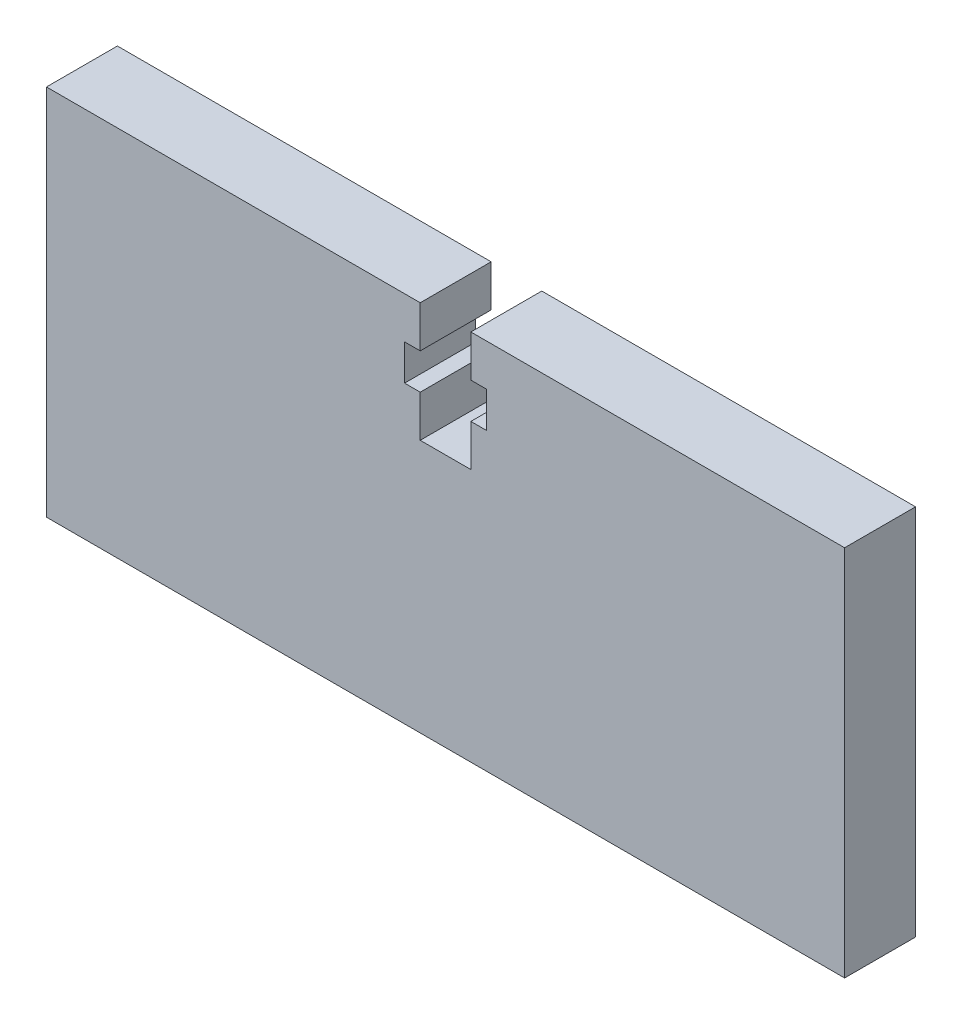
ISO-10303-21;
HEADER;
FILE_DESCRIPTION(('STEP AP214'),'2;1');
FILE_NAME('part.step','',(''),(''),'','','');
FILE_SCHEMA(('AUTOMOTIVE_DESIGN { 1 0 10303 214 1 1 1 1 }'));
ENDSEC;
DATA;
#1=APPLICATION_CONTEXT('core data for automotive mechanical design processes');
#2=APPLICATION_PROTOCOL_DEFINITION('international standard','automotive_design',2000,#1);
#3=PRODUCT_CONTEXT('',#1,'mechanical');
#4=PRODUCT('Part','Part','',(#3));
#5=PRODUCT_RELATED_PRODUCT_CATEGORY('part','',(#4));
#6=PRODUCT_DEFINITION_FORMATION('','',#4);
#7=PRODUCT_DEFINITION_CONTEXT('part definition',#1,'design');
#8=PRODUCT_DEFINITION('design','',#6,#7);
#9=PRODUCT_DEFINITION_SHAPE('','',#8);
#10=(LENGTH_UNIT() NAMED_UNIT(*) SI_UNIT(.MILLI.,.METRE.));
#11=(NAMED_UNIT(*) PLANE_ANGLE_UNIT() SI_UNIT($,.RADIAN.));
#12=(NAMED_UNIT(*) SI_UNIT($,.STERADIAN.) SOLID_ANGLE_UNIT());
#13=UNCERTAINTY_MEASURE_WITH_UNIT(LENGTH_MEASURE(1.E-05),#10,'distance_accuracy_value','');
#14=(GEOMETRIC_REPRESENTATION_CONTEXT(3) GLOBAL_UNCERTAINTY_ASSIGNED_CONTEXT((#13)) GLOBAL_UNIT_ASSIGNED_CONTEXT((#10,
#11,#12)) REPRESENTATION_CONTEXT('',''));
#15=CARTESIAN_POINT('',(0.,0.,0.));
#16=DIRECTION('',(0.,0.,1.));
#17=DIRECTION('',(1.,0.,0.));
#18=AXIS2_PLACEMENT_3D('',#15,#16,#17);
#19=CARTESIAN_POINT('',(-26.797,0.,4.7625));
#20=DIRECTION('',(-1.,0.,0.));
#21=DIRECTION('',(0.,0.,1.));
#22=AXIS2_PLACEMENT_3D('',#19,#20,#21);
#23=PLANE('',#22);
#24=DIRECTION('',(0.,1.,0.));
#25=VECTOR('',#24,1.);
#26=CARTESIAN_POINT('',(-26.797,0.,0.));
#27=LINE('',#26,#25);
#28=CARTESIAN_POINT('',(-26.797,-8.51,0.));
#29=VERTEX_POINT('',#28);
#30=CARTESIAN_POINT('',(-26.797,16.51,0.));
#31=VERTEX_POINT('',#30);
#32=EDGE_CURVE('E178',#29,#31,#27,.T.);
#33=ORIENTED_EDGE('',*,*,#32,.F.);
#34=DIRECTION('',(0.,0.,-1.));
#35=VECTOR('',#34,1.);
#36=CARTESIAN_POINT('',(-26.797,-8.51,4.7625));
#37=LINE('',#36,#35);
#38=CARTESIAN_POINT('',(-26.797,-8.51,4.7625));
#39=VERTEX_POINT('',#38);
#40=EDGE_CURVE('E11',#39,#29,#37,.T.);
#41=ORIENTED_EDGE('',*,*,#40,.F.);
#42=DIRECTION('',(0.,1.,0.));
#43=VECTOR('',#42,1.);
#44=CARTESIAN_POINT('',(-26.797,0.,4.7625));
#45=LINE('',#44,#43);
#46=CARTESIAN_POINT('',(-26.797,16.51,4.7625));
#47=VERTEX_POINT('',#46);
#48=EDGE_CURVE('E220',#39,#47,#45,.T.);
#49=ORIENTED_EDGE('',*,*,#48,.T.);
#50=DIRECTION('',(0.,0.,-1.));
#51=VECTOR('',#50,1.);
#52=CARTESIAN_POINT('',(-26.797,16.51,4.7625));
#53=LINE('',#52,#51);
#54=EDGE_CURVE('E52',#47,#31,#53,.T.);
#55=ORIENTED_EDGE('',*,*,#54,.T.);
#56=EDGE_LOOP('',(#33,#41,#49,#55));
#57=FACE_BOUND('',#56,.T.);
#58=ADVANCED_FACE('F36',(#57),#23,.T.);
#59=CARTESIAN_POINT('',(0.,-8.51,4.7625));
#60=DIRECTION('',(0.,1.,0.));
#61=DIRECTION('',(-1.,0.,0.));
#62=AXIS2_PLACEMENT_3D('',#59,#60,#61);
#63=PLANE('',#62);
#64=DIRECTION('',(1.,0.,0.));
#65=VECTOR('',#64,1.);
#66=CARTESIAN_POINT('',(0.,-8.51,0.));
#67=LINE('',#66,#65);
#68=CARTESIAN_POINT('',(26.797,-8.51,0.));
#69=VERTEX_POINT('',#68);
#70=EDGE_CURVE('E181',#29,#69,#67,.T.);
#71=ORIENTED_EDGE('',*,*,#70,.T.);
#72=DIRECTION('',(0.,0.,-1.));
#73=VECTOR('',#72,1.);
#74=CARTESIAN_POINT('',(26.797,-8.51,4.7625));
#75=LINE('',#74,#73);
#76=CARTESIAN_POINT('',(26.797,-8.51,4.7625));
#77=VERTEX_POINT('',#76);
#78=EDGE_CURVE('E44',#77,#69,#75,.T.);
#79=ORIENTED_EDGE('',*,*,#78,.F.);
#80=DIRECTION('',(1.,0.,0.));
#81=VECTOR('',#80,1.);
#82=CARTESIAN_POINT('',(0.,-8.51,4.7625));
#83=LINE('',#82,#81);
#84=EDGE_CURVE('E274',#39,#77,#83,.T.);
#85=ORIENTED_EDGE('',*,*,#84,.F.);
#86=ORIENTED_EDGE('',*,*,#40,.T.);
#87=EDGE_LOOP('',(#71,#79,#85,#86));
#88=FACE_BOUND('',#87,.T.);
#89=ADVANCED_FACE('F308',(#88),#63,.F.);
#90=CARTESIAN_POINT('',(26.797,0.,4.7625));
#91=DIRECTION('',(-1.,0.,0.));
#92=DIRECTION('',(0.,0.,1.));
#93=AXIS2_PLACEMENT_3D('',#90,#91,#92);
#94=PLANE('',#93);
#95=DIRECTION('',(0.,1.,0.));
#96=VECTOR('',#95,1.);
#97=CARTESIAN_POINT('',(26.797,0.,0.));
#98=LINE('',#97,#96);
#99=CARTESIAN_POINT('',(26.797,16.51,0.));
#100=VERTEX_POINT('',#99);
#101=EDGE_CURVE('E183',#69,#100,#98,.T.);
#102=ORIENTED_EDGE('',*,*,#101,.T.);
#103=DIRECTION('',(0.,0.,-1.));
#104=VECTOR('',#103,1.);
#105=CARTESIAN_POINT('',(26.797,16.51,4.7625));
#106=LINE('',#105,#104);
#107=CARTESIAN_POINT('',(26.797,16.51,4.7625));
#108=VERTEX_POINT('',#107);
#109=EDGE_CURVE('E247',#108,#100,#106,.T.);
#110=ORIENTED_EDGE('',*,*,#109,.F.);
#111=DIRECTION('',(0.,1.,0.));
#112=VECTOR('',#111,1.);
#113=CARTESIAN_POINT('',(26.797,0.,4.7625));
#114=LINE('',#113,#112);
#115=EDGE_CURVE('E255',#77,#108,#114,.T.);
#116=ORIENTED_EDGE('',*,*,#115,.F.);
#117=ORIENTED_EDGE('',*,*,#78,.T.);
#118=EDGE_LOOP('',(#102,#110,#116,#117));
#119=FACE_BOUND('',#118,.T.);
#120=ADVANCED_FACE('F253',(#119),#94,.F.);
#121=CARTESIAN_POINT('',(0.,16.51,4.7625));
#122=DIRECTION('',(0.,1.,0.));
#123=DIRECTION('',(-1.,0.,0.));
#124=AXIS2_PLACEMENT_3D('',#121,#122,#123);
#125=PLANE('',#124);
#126=DIRECTION('',(1.,0.,0.));
#127=VECTOR('',#126,1.);
#128=CARTESIAN_POINT('',(0.,16.51,0.));
#129=LINE('',#128,#127);
#130=CARTESIAN_POINT('',(1.69999999999999,16.51,0.));
#131=VERTEX_POINT('',#130);
#132=EDGE_CURVE('E187',#131,#100,#129,.T.);
#133=ORIENTED_EDGE('',*,*,#132,.F.);
#134=DIRECTION('',(0.,0.,-1.));
#135=VECTOR('',#134,1.);
#136=CARTESIAN_POINT('',(1.69999999999999,16.51,4.7625));
#137=LINE('',#136,#135);
#138=CARTESIAN_POINT('',(1.69999999999999,16.51,4.7625));
#139=VERTEX_POINT('',#138);
#140=EDGE_CURVE('E245',#139,#131,#137,.T.);
#141=ORIENTED_EDGE('',*,*,#140,.F.);
#142=DIRECTION('',(1.,0.,0.));
#143=VECTOR('',#142,1.);
#144=CARTESIAN_POINT('',(0.,16.51,4.7625));
#145=LINE('',#144,#143);
#146=EDGE_CURVE('E268',#139,#108,#145,.T.);
#147=ORIENTED_EDGE('',*,*,#146,.T.);
#148=ORIENTED_EDGE('',*,*,#109,.T.);
#149=EDGE_LOOP('',(#133,#141,#147,#148));
#150=FACE_BOUND('',#149,.T.);
#151=ADVANCED_FACE('F264',(#150),#125,.T.);
#152=CARTESIAN_POINT('',(1.70000000000004,0.,4.7625));
#153=DIRECTION('',(1.,0.,0.));
#154=DIRECTION('',(0.,1.,0.));
#155=AXIS2_PLACEMENT_3D('',#152,#153,#154);
#156=PLANE('',#155);
#157=DIRECTION('',(0.,-1.,0.));
#158=VECTOR('',#157,1.);
#159=CARTESIAN_POINT('',(1.70000000000004,0.,0.));
#160=LINE('',#159,#158);
#161=CARTESIAN_POINT('',(1.7,13.71,0.));
#162=VERTEX_POINT('',#161);
#163=EDGE_CURVE('E190',#131,#162,#160,.T.);
#164=ORIENTED_EDGE('',*,*,#163,.T.);
#165=DIRECTION('',(0.,0.,-1.));
#166=VECTOR('',#165,1.);
#167=CARTESIAN_POINT('',(1.7,13.71,4.7625));
#168=LINE('',#167,#166);
#169=CARTESIAN_POINT('',(1.7,13.71,4.7625));
#170=VERTEX_POINT('',#169);
#171=EDGE_CURVE('E242',#170,#162,#168,.T.);
#172=ORIENTED_EDGE('',*,*,#171,.F.);
#173=DIRECTION('',(0.,-1.,0.));
#174=VECTOR('',#173,1.);
#175=CARTESIAN_POINT('',(1.70000000000004,0.,4.7625));
#176=LINE('',#175,#174);
#177=EDGE_CURVE('E269',#139,#170,#176,.T.);
#178=ORIENTED_EDGE('',*,*,#177,.F.);
#179=ORIENTED_EDGE('',*,*,#140,.T.);
#180=EDGE_LOOP('',(#164,#172,#178,#179));
#181=FACE_BOUND('',#180,.T.);
#182=ADVANCED_FACE('F319',(#181),#156,.F.);
#183=CARTESIAN_POINT('',(0.,13.71,4.7625));
#184=DIRECTION('',(0.,1.,0.));
#185=DIRECTION('',(0.,0.,1.));
#186=AXIS2_PLACEMENT_3D('',#183,#184,#185);
#187=PLANE('',#186);
#188=DIRECTION('',(1.,0.,0.));
#189=VECTOR('',#188,1.);
#190=CARTESIAN_POINT('',(0.,13.71,0.));
#191=LINE('',#190,#189);
#192=CARTESIAN_POINT('',(2.75,13.71,0.));
#193=VERTEX_POINT('',#192);
#194=EDGE_CURVE('E192',#162,#193,#191,.T.);
#195=ORIENTED_EDGE('',*,*,#194,.T.);
#196=DIRECTION('',(0.,0.,-1.));
#197=VECTOR('',#196,1.);
#198=CARTESIAN_POINT('',(2.75,13.71,4.7625));
#199=LINE('',#198,#197);
#200=CARTESIAN_POINT('',(2.75,13.71,4.7625));
#201=VERTEX_POINT('',#200);
#202=EDGE_CURVE('E239',#201,#193,#199,.T.);
#203=ORIENTED_EDGE('',*,*,#202,.F.);
#204=DIRECTION('',(1.,0.,0.));
#205=VECTOR('',#204,1.);
#206=CARTESIAN_POINT('',(0.,13.71,4.7625));
#207=LINE('',#206,#205);
#208=EDGE_CURVE('E271',#170,#201,#207,.T.);
#209=ORIENTED_EDGE('',*,*,#208,.F.);
#210=ORIENTED_EDGE('',*,*,#171,.T.);
#211=EDGE_LOOP('',(#195,#203,#209,#210));
#212=FACE_BOUND('',#211,.T.);
#213=ADVANCED_FACE('F322',(#212),#187,.F.);
#214=CARTESIAN_POINT('',(2.75,0.,4.7625));
#215=DIRECTION('',(1.,0.,0.));
#216=DIRECTION('',(0.,0.,-1.));
#217=AXIS2_PLACEMENT_3D('',#214,#215,#216);
#218=PLANE('',#217);
#219=DIRECTION('',(0.,-1.,0.));
#220=VECTOR('',#219,1.);
#221=CARTESIAN_POINT('',(2.75,0.,0.));
#222=LINE('',#221,#220);
#223=CARTESIAN_POINT('',(2.75,11.31,0.));
#224=VERTEX_POINT('',#223);
#225=EDGE_CURVE('E194',#193,#224,#222,.T.);
#226=ORIENTED_EDGE('',*,*,#225,.T.);
#227=DIRECTION('',(0.,0.,-1.));
#228=VECTOR('',#227,1.);
#229=CARTESIAN_POINT('',(2.75,11.31,4.7625));
#230=LINE('',#229,#228);
#231=CARTESIAN_POINT('',(2.75,11.31,4.7625));
#232=VERTEX_POINT('',#231);
#233=EDGE_CURVE('E236',#232,#224,#230,.T.);
#234=ORIENTED_EDGE('',*,*,#233,.F.);
#235=DIRECTION('',(0.,-1.,0.));
#236=VECTOR('',#235,1.);
#237=CARTESIAN_POINT('',(2.75,0.,4.7625));
#238=LINE('',#237,#236);
#239=EDGE_CURVE('E279',#201,#232,#238,.T.);
#240=ORIENTED_EDGE('',*,*,#239,.F.);
#241=ORIENTED_EDGE('',*,*,#202,.T.);
#242=EDGE_LOOP('',(#226,#234,#240,#241));
#243=FACE_BOUND('',#242,.T.);
#244=ADVANCED_FACE('F326',(#243),#218,.F.);
#245=CARTESIAN_POINT('',(0.,11.31,4.7625));
#246=DIRECTION('',(0.,-1.,0.));
#247=DIRECTION('',(0.,0.,-1.));
#248=AXIS2_PLACEMENT_3D('',#245,#246,#247);
#249=PLANE('',#248);
#250=DIRECTION('',(-1.,0.,0.));
#251=VECTOR('',#250,1.);
#252=CARTESIAN_POINT('',(0.,11.31,0.));
#253=LINE('',#252,#251);
#254=CARTESIAN_POINT('',(1.7,11.31,0.));
#255=VERTEX_POINT('',#254);
#256=EDGE_CURVE('E196',#224,#255,#253,.T.);
#257=ORIENTED_EDGE('',*,*,#256,.T.);
#258=DIRECTION('',(0.,0.,-1.));
#259=VECTOR('',#258,1.);
#260=CARTESIAN_POINT('',(1.7,11.31,4.7625));
#261=LINE('',#260,#259);
#262=CARTESIAN_POINT('',(1.7,11.31,4.7625));
#263=VERTEX_POINT('',#262);
#264=EDGE_CURVE('E233',#263,#255,#261,.T.);
#265=ORIENTED_EDGE('',*,*,#264,.F.);
#266=DIRECTION('',(-1.,0.,0.));
#267=VECTOR('',#266,1.);
#268=CARTESIAN_POINT('',(0.,11.31,4.7625));
#269=LINE('',#268,#267);
#270=EDGE_CURVE('E281',#232,#263,#269,.T.);
#271=ORIENTED_EDGE('',*,*,#270,.F.);
#272=ORIENTED_EDGE('',*,*,#233,.T.);
#273=EDGE_LOOP('',(#257,#265,#271,#272));
#274=FACE_BOUND('',#273,.T.);
#275=ADVANCED_FACE('F330',(#274),#249,.F.);
#276=CARTESIAN_POINT('',(1.69999999999988,0.,4.7625));
#277=DIRECTION('',(1.,0.,0.));
#278=DIRECTION('',(0.,1.,0.));
#279=AXIS2_PLACEMENT_3D('',#276,#277,#278);
#280=PLANE('',#279);
#281=DIRECTION('',(0.,-1.,0.));
#282=VECTOR('',#281,1.);
#283=CARTESIAN_POINT('',(1.69999999999988,0.,0.));
#284=LINE('',#283,#282);
#285=CARTESIAN_POINT('',(1.69999999999997,8.51,0.));
#286=VERTEX_POINT('',#285);
#287=EDGE_CURVE('E198',#255,#286,#284,.T.);
#288=ORIENTED_EDGE('',*,*,#287,.T.);
#289=DIRECTION('',(0.,0.,-1.));
#290=VECTOR('',#289,1.);
#291=CARTESIAN_POINT('',(1.69999999999997,8.51,4.7625));
#292=LINE('',#291,#290);
#293=CARTESIAN_POINT('',(1.69999999999997,8.51,4.7625));
#294=VERTEX_POINT('',#293);
#295=EDGE_CURVE('E231',#294,#286,#292,.T.);
#296=ORIENTED_EDGE('',*,*,#295,.F.);
#297=DIRECTION('',(0.,-1.,0.));
#298=VECTOR('',#297,1.);
#299=CARTESIAN_POINT('',(1.69999999999988,0.,4.7625));
#300=LINE('',#299,#298);
#301=EDGE_CURVE('E283',#263,#294,#300,.T.);
#302=ORIENTED_EDGE('',*,*,#301,.F.);
#303=ORIENTED_EDGE('',*,*,#264,.T.);
#304=EDGE_LOOP('',(#288,#296,#302,#303));
#305=FACE_BOUND('',#304,.T.);
#306=ADVANCED_FACE('F334',(#305),#280,.F.);
#307=CARTESIAN_POINT('',(0.,8.51,4.7625));
#308=DIRECTION('',(0.,1.,0.));
#309=DIRECTION('',(-1.,0.,0.));
#310=AXIS2_PLACEMENT_3D('',#307,#308,#309);
#311=PLANE('',#310);
#312=DIRECTION('',(1.,0.,0.));
#313=VECTOR('',#312,1.);
#314=CARTESIAN_POINT('',(0.,8.51,0.));
#315=LINE('',#314,#313);
#316=CARTESIAN_POINT('',(-1.7,8.51,0.));
#317=VERTEX_POINT('',#316);
#318=EDGE_CURVE('E201',#317,#286,#315,.T.);
#319=ORIENTED_EDGE('',*,*,#318,.F.);
#320=DIRECTION('',(0.,0.,-1.));
#321=VECTOR('',#320,1.);
#322=CARTESIAN_POINT('',(-1.7,8.51,4.7625));
#323=LINE('',#322,#321);
#324=CARTESIAN_POINT('',(-1.7,8.51,4.7625));
#325=VERTEX_POINT('',#324);
#326=EDGE_CURVE('E229',#325,#317,#323,.T.);
#327=ORIENTED_EDGE('',*,*,#326,.F.);
#328=DIRECTION('',(1.,0.,0.));
#329=VECTOR('',#328,1.);
#330=CARTESIAN_POINT('',(0.,8.51,4.7625));
#331=LINE('',#330,#329);
#332=EDGE_CURVE('E285',#325,#294,#331,.T.);
#333=ORIENTED_EDGE('',*,*,#332,.T.);
#334=ORIENTED_EDGE('',*,*,#295,.T.);
#335=EDGE_LOOP('',(#319,#327,#333,#334));
#336=FACE_BOUND('',#335,.T.);
#337=ADVANCED_FACE('F338',(#336),#311,.T.);
#338=CARTESIAN_POINT('',(-1.7,0.,4.7625));
#339=DIRECTION('',(1.,0.,0.));
#340=DIRECTION('',(0.,1.,0.));
#341=AXIS2_PLACEMENT_3D('',#338,#339,#340);
#342=PLANE('',#341);
#343=DIRECTION('',(0.,-1.,0.));
#344=VECTOR('',#343,1.);
#345=CARTESIAN_POINT('',(-1.7,0.,0.));
#346=LINE('',#345,#344);
#347=CARTESIAN_POINT('',(-1.7,11.31,0.));
#348=VERTEX_POINT('',#347);
#349=EDGE_CURVE('E205',#348,#317,#346,.T.);
#350=ORIENTED_EDGE('',*,*,#349,.F.);
#351=DIRECTION('',(0.,0.,-1.));
#352=VECTOR('',#351,1.);
#353=CARTESIAN_POINT('',(-1.7,11.31,4.7625));
#354=LINE('',#353,#352);
#355=CARTESIAN_POINT('',(-1.7,11.31,4.7625));
#356=VERTEX_POINT('',#355);
#357=EDGE_CURVE('E227',#356,#348,#354,.T.);
#358=ORIENTED_EDGE('',*,*,#357,.F.);
#359=DIRECTION('',(0.,-1.,0.));
#360=VECTOR('',#359,1.);
#361=CARTESIAN_POINT('',(-1.7,0.,4.7625));
#362=LINE('',#361,#360);
#363=EDGE_CURVE('E288',#356,#325,#362,.T.);
#364=ORIENTED_EDGE('',*,*,#363,.T.);
#365=ORIENTED_EDGE('',*,*,#326,.T.);
#366=EDGE_LOOP('',(#350,#358,#364,#365));
#367=FACE_BOUND('',#366,.T.);
#368=ADVANCED_FACE('F342',(#367),#342,.T.);
#369=CARTESIAN_POINT('',(0.,11.31,4.7625));
#370=DIRECTION('',(0.,1.,0.));
#371=DIRECTION('',(0.,0.,1.));
#372=AXIS2_PLACEMENT_3D('',#369,#370,#371);
#373=PLANE('',#372);
#374=DIRECTION('',(1.,0.,0.));
#375=VECTOR('',#374,1.);
#376=CARTESIAN_POINT('',(0.,11.31,0.));
#377=LINE('',#376,#375);
#378=CARTESIAN_POINT('',(-2.75,11.31,0.));
#379=VERTEX_POINT('',#378);
#380=EDGE_CURVE('E208',#379,#348,#377,.T.);
#381=ORIENTED_EDGE('',*,*,#380,.F.);
#382=DIRECTION('',(0.,0.,-1.));
#383=VECTOR('',#382,1.);
#384=CARTESIAN_POINT('',(-2.75,11.31,4.7625));
#385=LINE('',#384,#383);
#386=CARTESIAN_POINT('',(-2.75,11.31,4.7625));
#387=VERTEX_POINT('',#386);
#388=EDGE_CURVE('E225',#387,#379,#385,.T.);
#389=ORIENTED_EDGE('',*,*,#388,.F.);
#390=DIRECTION('',(1.,0.,0.));
#391=VECTOR('',#390,1.);
#392=CARTESIAN_POINT('',(0.,11.31,4.7625));
#393=LINE('',#392,#391);
#394=EDGE_CURVE('E291',#387,#356,#393,.T.);
#395=ORIENTED_EDGE('',*,*,#394,.T.);
#396=ORIENTED_EDGE('',*,*,#357,.T.);
#397=EDGE_LOOP('',(#381,#389,#395,#396));
#398=FACE_BOUND('',#397,.T.);
#399=ADVANCED_FACE('F346',(#398),#373,.T.);
#400=CARTESIAN_POINT('',(-2.75,0.,4.7625));
#401=DIRECTION('',(1.,0.,0.));
#402=DIRECTION('',(0.,0.,-1.));
#403=AXIS2_PLACEMENT_3D('',#400,#401,#402);
#404=PLANE('',#403);
#405=DIRECTION('',(0.,-1.,0.));
#406=VECTOR('',#405,1.);
#407=CARTESIAN_POINT('',(-2.75,0.,0.));
#408=LINE('',#407,#406);
#409=CARTESIAN_POINT('',(-2.75,13.71,0.));
#410=VERTEX_POINT('',#409);
#411=EDGE_CURVE('E211',#410,#379,#408,.T.);
#412=ORIENTED_EDGE('',*,*,#411,.F.);
#413=DIRECTION('',(0.,0.,-1.));
#414=VECTOR('',#413,1.);
#415=CARTESIAN_POINT('',(-2.75,13.71,4.7625));
#416=LINE('',#415,#414);
#417=CARTESIAN_POINT('',(-2.75,13.71,4.7625));
#418=VERTEX_POINT('',#417);
#419=EDGE_CURVE('E159',#418,#410,#416,.T.);
#420=ORIENTED_EDGE('',*,*,#419,.F.);
#421=DIRECTION('',(0.,-1.,0.));
#422=VECTOR('',#421,1.);
#423=CARTESIAN_POINT('',(-2.75,0.,4.7625));
#424=LINE('',#423,#422);
#425=EDGE_CURVE('E170',#418,#387,#424,.T.);
#426=ORIENTED_EDGE('',*,*,#425,.T.);
#427=ORIENTED_EDGE('',*,*,#388,.T.);
#428=EDGE_LOOP('',(#412,#420,#426,#427));
#429=FACE_BOUND('',#428,.T.);
#430=ADVANCED_FACE('F295',(#429),#404,.T.);
#431=CARTESIAN_POINT('',(0.,13.71,4.7625));
#432=DIRECTION('',(0.,-1.,0.));
#433=DIRECTION('',(0.,0.,-1.));
#434=AXIS2_PLACEMENT_3D('',#431,#432,#433);
#435=PLANE('',#434);
#436=DIRECTION('',(-1.,0.,0.));
#437=VECTOR('',#436,1.);
#438=CARTESIAN_POINT('',(0.,13.71,0.));
#439=LINE('',#438,#437);
#440=CARTESIAN_POINT('',(-1.7,13.71,0.));
#441=VERTEX_POINT('',#440);
#442=EDGE_CURVE('E155',#441,#410,#439,.T.);
#443=ORIENTED_EDGE('',*,*,#442,.F.);
#444=DIRECTION('',(0.,0.,-1.));
#445=VECTOR('',#444,1.);
#446=CARTESIAN_POINT('',(-1.7,13.71,4.7625));
#447=LINE('',#446,#445);
#448=CARTESIAN_POINT('',(-1.7,13.71,4.7625));
#449=VERTEX_POINT('',#448);
#450=EDGE_CURVE('E150',#449,#441,#447,.T.);
#451=ORIENTED_EDGE('',*,*,#450,.F.);
#452=DIRECTION('',(-1.,0.,0.));
#453=VECTOR('',#452,1.);
#454=CARTESIAN_POINT('',(0.,13.71,4.7625));
#455=LINE('',#454,#453);
#456=EDGE_CURVE('E153',#449,#418,#455,.T.);
#457=ORIENTED_EDGE('',*,*,#456,.T.);
#458=ORIENTED_EDGE('',*,*,#419,.T.);
#459=EDGE_LOOP('',(#443,#451,#457,#458));
#460=FACE_BOUND('',#459,.T.);
#461=ADVANCED_FACE('F152',(#460),#435,.T.);
#462=CARTESIAN_POINT('',(-1.7,0.,4.7625));
#463=DIRECTION('',(1.,0.,0.));
#464=DIRECTION('',(0.,1.,0.));
#465=AXIS2_PLACEMENT_3D('',#462,#463,#464);
#466=PLANE('',#465);
#467=DIRECTION('',(0.,-1.,0.));
#468=VECTOR('',#467,1.);
#469=CARTESIAN_POINT('',(-1.7,0.,0.));
#470=LINE('',#469,#468);
#471=CARTESIAN_POINT('',(-1.7,16.51,0.));
#472=VERTEX_POINT('',#471);
#473=EDGE_CURVE('E215',#472,#441,#470,.T.);
#474=ORIENTED_EDGE('',*,*,#473,.F.);
#475=DIRECTION('',(0.,0.,-1.));
#476=VECTOR('',#475,1.);
#477=CARTESIAN_POINT('',(-1.7,16.51,4.7625));
#478=LINE('',#477,#476);
#479=CARTESIAN_POINT('',(-1.7,16.51,4.7625));
#480=VERTEX_POINT('',#479);
#481=EDGE_CURVE('E101',#480,#472,#478,.T.);
#482=ORIENTED_EDGE('',*,*,#481,.F.);
#483=DIRECTION('',(0.,-1.,0.));
#484=VECTOR('',#483,1.);
#485=CARTESIAN_POINT('',(-1.7,0.,4.7625));
#486=LINE('',#485,#484);
#487=EDGE_CURVE('E167',#480,#449,#486,.T.);
#488=ORIENTED_EDGE('',*,*,#487,.T.);
#489=ORIENTED_EDGE('',*,*,#450,.T.);
#490=EDGE_LOOP('',(#474,#482,#488,#489));
#491=FACE_BOUND('',#490,.T.);
#492=ADVANCED_FACE('F172',(#491),#466,.T.);
#493=CARTESIAN_POINT('',(0.,16.51,4.7625));
#494=DIRECTION('',(0.,1.,0.));
#495=DIRECTION('',(0.,0.,1.));
#496=AXIS2_PLACEMENT_3D('',#493,#494,#495);
#497=PLANE('',#496);
#498=DIRECTION('',(1.,0.,0.));
#499=VECTOR('',#498,1.);
#500=CARTESIAN_POINT('',(0.,16.51,0.));
#501=LINE('',#500,#499);
#502=EDGE_CURVE('E217',#31,#472,#501,.T.);
#503=ORIENTED_EDGE('',*,*,#502,.F.);
#504=ORIENTED_EDGE('',*,*,#54,.F.);
#505=DIRECTION('',(1.,0.,0.));
#506=VECTOR('',#505,1.);
#507=CARTESIAN_POINT('',(0.,16.51,4.7625));
#508=LINE('',#507,#506);
#509=EDGE_CURVE('E173',#47,#480,#508,.T.);
#510=ORIENTED_EDGE('',*,*,#509,.T.);
#511=ORIENTED_EDGE('',*,*,#481,.T.);
#512=EDGE_LOOP('',(#503,#504,#510,#511));
#513=FACE_BOUND('',#512,.T.);
#514=ADVANCED_FACE('F297',(#513),#497,.T.);
#515=CARTESIAN_POINT('',(0.,0.,4.7625));
#516=DIRECTION('',(0.,0.,1.));
#517=DIRECTION('',(1.,0.,0.));
#518=AXIS2_PLACEMENT_3D('',#515,#516,#517);
#519=PLANE('',#518);
#520=ORIENTED_EDGE('',*,*,#48,.F.);
#521=ORIENTED_EDGE('',*,*,#84,.T.);
#522=ORIENTED_EDGE('',*,*,#115,.T.);
#523=ORIENTED_EDGE('',*,*,#146,.F.);
#524=ORIENTED_EDGE('',*,*,#177,.T.);
#525=ORIENTED_EDGE('',*,*,#208,.T.);
#526=ORIENTED_EDGE('',*,*,#239,.T.);
#527=ORIENTED_EDGE('',*,*,#270,.T.);
#528=ORIENTED_EDGE('',*,*,#301,.T.);
#529=ORIENTED_EDGE('',*,*,#332,.F.);
#530=ORIENTED_EDGE('',*,*,#363,.F.);
#531=ORIENTED_EDGE('',*,*,#394,.F.);
#532=ORIENTED_EDGE('',*,*,#425,.F.);
#533=ORIENTED_EDGE('',*,*,#456,.F.);
#534=ORIENTED_EDGE('',*,*,#487,.F.);
#535=ORIENTED_EDGE('',*,*,#509,.F.);
#536=EDGE_LOOP('',(#520,#521,#522,#523,#524,#525,#526,#527,#528,#529,#530,#531,#532,#533,#534,#535));
#537=FACE_BOUND('',#536,.T.);
#538=ADVANCED_FACE('F165',(#537),#519,.T.);
#539=CARTESIAN_POINT('',(0.,0.,0.));
#540=DIRECTION('',(0.,0.,1.));
#541=DIRECTION('',(1.,0.,0.));
#542=AXIS2_PLACEMENT_3D('',#539,#540,#541);
#543=PLANE('',#542);
#544=ORIENTED_EDGE('',*,*,#32,.T.);
#545=ORIENTED_EDGE('',*,*,#502,.T.);
#546=ORIENTED_EDGE('',*,*,#473,.T.);
#547=ORIENTED_EDGE('',*,*,#442,.T.);
#548=ORIENTED_EDGE('',*,*,#411,.T.);
#549=ORIENTED_EDGE('',*,*,#380,.T.);
#550=ORIENTED_EDGE('',*,*,#349,.T.);
#551=ORIENTED_EDGE('',*,*,#318,.T.);
#552=ORIENTED_EDGE('',*,*,#287,.F.);
#553=ORIENTED_EDGE('',*,*,#256,.F.);
#554=ORIENTED_EDGE('',*,*,#225,.F.);
#555=ORIENTED_EDGE('',*,*,#194,.F.);
#556=ORIENTED_EDGE('',*,*,#163,.F.);
#557=ORIENTED_EDGE('',*,*,#132,.T.);
#558=ORIENTED_EDGE('',*,*,#101,.F.);
#559=ORIENTED_EDGE('',*,*,#70,.F.);
#560=EDGE_LOOP('',(#544,#545,#546,#547,#548,#549,#550,#551,#552,#553,#554,#555,#556,#557,#558,#559));
#561=FACE_BOUND('',#560,.T.);
#562=ADVANCED_FACE('F259',(#561),#543,.F.);
#563=CLOSED_SHELL('',(#58,#89,#120,#151,#182,#213,#244,#275,#306,#337,#368,#399,#430,#461,#492,
#514,#538,#562));
#564=MANIFOLD_SOLID_BREP('B2',#563);
#565=ADVANCED_BREP_SHAPE_REPRESENTATION('',(#18,#564),#14);
#566=SHAPE_DEFINITION_REPRESENTATION(#9,#565);
ENDSEC;
END-ISO-10303-21;
